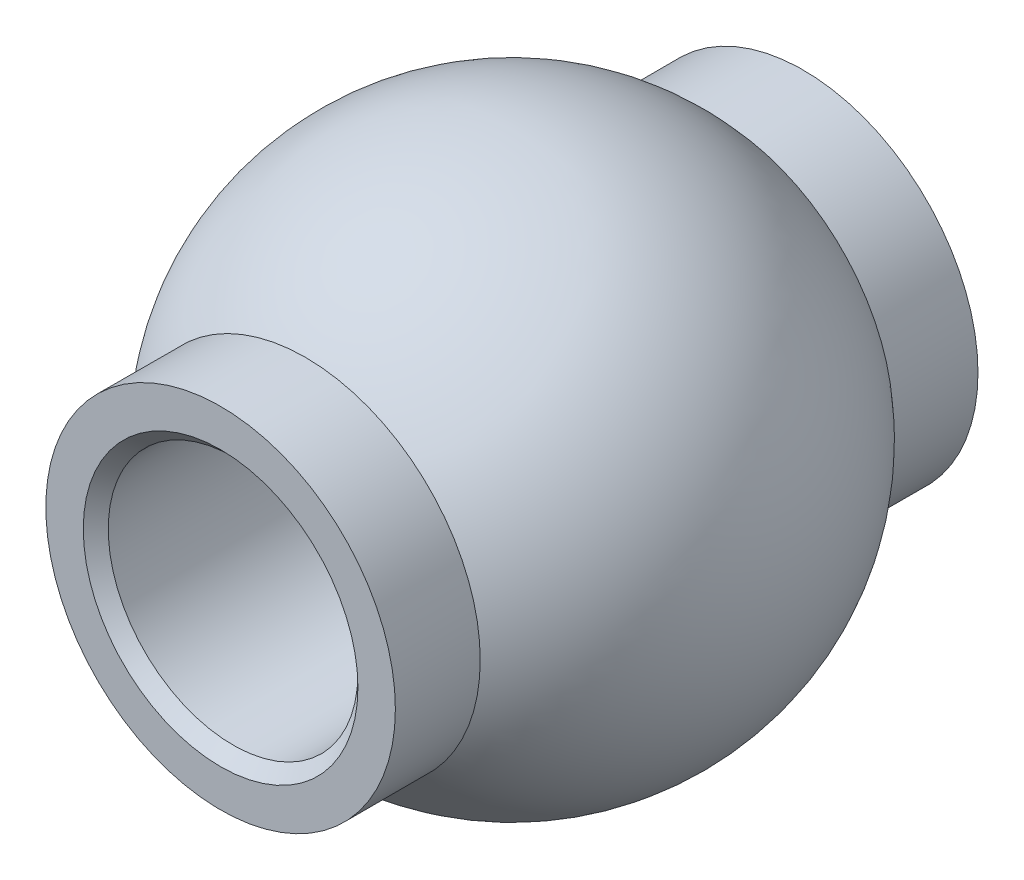
ISO-10303-21;
HEADER;
FILE_DESCRIPTION(('STEP AP214'),'2;1');
FILE_NAME('part.step','',(''),(''),'','','');
FILE_SCHEMA(('AUTOMOTIVE_DESIGN { 1 0 10303 214 1 1 1 1 }'));
ENDSEC;
DATA;
#1=APPLICATION_CONTEXT('core data for automotive mechanical design processes');
#2=APPLICATION_PROTOCOL_DEFINITION('international standard','automotive_design',2000,#1);
#3=PRODUCT_CONTEXT('',#1,'mechanical');
#4=PRODUCT('Part','Part','',(#3));
#5=PRODUCT_RELATED_PRODUCT_CATEGORY('part','',(#4));
#6=PRODUCT_DEFINITION_FORMATION('','',#4);
#7=PRODUCT_DEFINITION_CONTEXT('part definition',#1,'design');
#8=PRODUCT_DEFINITION('design','',#6,#7);
#9=PRODUCT_DEFINITION_SHAPE('','',#8);
#10=(LENGTH_UNIT() NAMED_UNIT(*) SI_UNIT(.MILLI.,.METRE.));
#11=(NAMED_UNIT(*) PLANE_ANGLE_UNIT() SI_UNIT($,.RADIAN.));
#12=(NAMED_UNIT(*) SI_UNIT($,.STERADIAN.) SOLID_ANGLE_UNIT());
#13=UNCERTAINTY_MEASURE_WITH_UNIT(LENGTH_MEASURE(1.E-05),#10,'distance_accuracy_value','');
#14=(GEOMETRIC_REPRESENTATION_CONTEXT(3) GLOBAL_UNCERTAINTY_ASSIGNED_CONTEXT((#13)) GLOBAL_UNIT_ASSIGNED_CONTEXT((#10,
#11,#12)) REPRESENTATION_CONTEXT('',''));
#15=CARTESIAN_POINT('',(0.,0.,0.));
#16=DIRECTION('',(0.,0.,1.));
#17=DIRECTION('',(1.,0.,0.));
#18=AXIS2_PLACEMENT_3D('',#15,#16,#17);
#19=CARTESIAN_POINT('',(0.,19.05,0.));
#20=DIRECTION('',(0.,-1.,0.));
#21=DIRECTION('',(-1.,0.,0.));
#22=AXIS2_PLACEMENT_3D('',#19,#20,#21);
#23=SPHERICAL_SURFACE('',#22,10.31875);
#24=CARTESIAN_POINT('',(0.,19.05,0.));
#25=DIRECTION('',(0.,0.,-1.));
#26=DIRECTION('',(-1.,0.,0.));
#27=AXIS2_PLACEMENT_3D('',#24,#25,#26);
#28=SPHERICAL_SURFACE('',#27,10.31875);
#29=CARTESIAN_POINT('',(0.,19.05,7.87534413930591));
#30=DIRECTION('',(0.,0.,-1.));
#31=DIRECTION('',(-1.,0.,0.));
#32=AXIS2_PLACEMENT_3D('',#29,#30,#31);
#33=CIRCLE('',#32,6.6675);
#34=CARTESIAN_POINT('',(-6.66750000000001,19.05,7.87534413930591));
#35=VERTEX_POINT('',#34);
#36=EDGE_CURVE('E59',#35,#35,#33,.F.);
#37=ORIENTED_EDGE('',*,*,#36,.F.);
#38=EDGE_LOOP('',(#37));
#39=FACE_BOUND('',#38,.T.);
#40=CARTESIAN_POINT('',(0.,19.05,-7.87534413930591));
#41=DIRECTION('',(0.,0.,1.));
#42=DIRECTION('',(1.,0.,0.));
#43=AXIS2_PLACEMENT_3D('',#40,#41,#42);
#44=CIRCLE('',#43,6.6675);
#45=CARTESIAN_POINT('',(6.66749999999999,19.05,-7.87534413930591));
#46=VERTEX_POINT('',#45);
#47=EDGE_CURVE('E62',#46,#46,#44,.F.);
#48=ORIENTED_EDGE('',*,*,#47,.F.);
#49=EDGE_LOOP('',(#48));
#50=FACE_BOUND('',#49,.T.);
#51=ADVANCED_FACE('F39',(#39,#50),#28,.T.);
#52=CARTESIAN_POINT('',(0.,19.05,-11.1125));
#53=DIRECTION('',(0.,0.,1.));
#54=DIRECTION('',(1.,0.,0.));
#55=AXIS2_PLACEMENT_3D('',#52,#53,#54);
#56=CYLINDRICAL_SURFACE('',#55,6.6675);
#57=ORIENTED_EDGE('',*,*,#47,.T.);
#58=EDGE_LOOP('',(#57));
#59=FACE_BOUND('',#58,.T.);
#60=CARTESIAN_POINT('',(0.,19.05,-11.1125));
#61=DIRECTION('',(0.,0.,1.));
#62=DIRECTION('',(1.,0.,0.));
#63=AXIS2_PLACEMENT_3D('',#60,#61,#62);
#64=CIRCLE('',#63,6.6675);
#65=CARTESIAN_POINT('',(6.66749999999999,19.05,-11.1125));
#66=VERTEX_POINT('',#65);
#67=EDGE_CURVE('E65',#66,#66,#64,.T.);
#68=ORIENTED_EDGE('',*,*,#67,.T.);
#69=EDGE_LOOP('',(#68));
#70=FACE_BOUND('',#69,.T.);
#71=ADVANCED_FACE('F79',(#59,#70),#56,.T.);
#72=CARTESIAN_POINT('',(0.,19.05,-11.1125));
#73=DIRECTION('',(0.,0.,1.));
#74=DIRECTION('',(1.,0.,0.));
#75=AXIS2_PLACEMENT_3D('',#72,#73,#74);
#76=PLANE('',#75);
#77=CARTESIAN_POINT('',(0.,19.05,-11.1125));
#78=DIRECTION('',(0.,0.,1.));
#79=DIRECTION('',(1.,0.,0.));
#80=AXIS2_PLACEMENT_3D('',#77,#78,#79);
#81=CIRCLE('',#80,5.23875);
#82=CARTESIAN_POINT('',(5.23874999999999,19.05,-11.1125));
#83=VERTEX_POINT('',#82);
#84=EDGE_CURVE('E54',#83,#83,#81,.T.);
#85=ORIENTED_EDGE('',*,*,#84,.T.);
#86=EDGE_LOOP('',(#85));
#87=FACE_BOUND('',#86,.T.);
#88=ORIENTED_EDGE('',*,*,#67,.F.);
#89=EDGE_LOOP('',(#88));
#90=FACE_BOUND('',#89,.T.);
#91=ADVANCED_FACE('F76',(#87,#90),#76,.F.);
#92=ORIENTED_EDGE('',*,*,#36,.T.);
#93=EDGE_LOOP('',(#92));
#94=FACE_BOUND('',#93,.T.);
#95=CARTESIAN_POINT('',(0.,19.05,11.1125));
#96=DIRECTION('',(0.,0.,1.));
#97=DIRECTION('',(1.,0.,0.));
#98=AXIS2_PLACEMENT_3D('',#95,#96,#97);
#99=CIRCLE('',#98,6.6675);
#100=CARTESIAN_POINT('',(6.66749999999999,19.05,11.1125));
#101=VERTEX_POINT('',#100);
#102=EDGE_CURVE('E68',#101,#101,#99,.T.);
#103=ORIENTED_EDGE('',*,*,#102,.F.);
#104=EDGE_LOOP('',(#103));
#105=FACE_BOUND('',#104,.T.);
#106=ADVANCED_FACE('F74',(#94,#105),#56,.T.);
#107=CARTESIAN_POINT('',(0.,19.05,11.1125));
#108=DIRECTION('',(0.,0.,1.));
#109=DIRECTION('',(1.,0.,0.));
#110=AXIS2_PLACEMENT_3D('',#107,#108,#109);
#111=PLANE('',#110);
#112=CARTESIAN_POINT('',(0.,19.05,11.1125));
#113=DIRECTION('',(0.,0.,1.));
#114=DIRECTION('',(1.,0.,0.));
#115=AXIS2_PLACEMENT_3D('',#112,#113,#114);
#116=CIRCLE('',#115,5.23875);
#117=CARTESIAN_POINT('',(5.23874999999999,19.05,11.1125));
#118=VERTEX_POINT('',#117);
#119=EDGE_CURVE('E10',#118,#118,#116,.F.);
#120=ORIENTED_EDGE('',*,*,#119,.T.);
#121=EDGE_LOOP('',(#120));
#122=FACE_BOUND('',#121,.T.);
#123=ORIENTED_EDGE('',*,*,#102,.T.);
#124=EDGE_LOOP('',(#123));
#125=FACE_BOUND('',#124,.T.);
#126=ADVANCED_FACE('F72',(#122,#125),#111,.T.);
#127=CARTESIAN_POINT('',(0.,19.05,-10.31875));
#128=DIRECTION('',(0.,0.,1.));
#129=DIRECTION('',(1.,0.,0.));
#130=AXIS2_PLACEMENT_3D('',#127,#128,#129);
#131=CYLINDRICAL_SURFACE('',#130,4.7625);
#132=CARTESIAN_POINT('',(0.,19.05,-10.63625));
#133=DIRECTION('',(0.,0.,1.));
#134=DIRECTION('',(1.,0.,0.));
#135=AXIS2_PLACEMENT_3D('',#132,#133,#134);
#136=CIRCLE('',#135,4.7625);
#137=CARTESIAN_POINT('',(4.76249999999999,19.05,-10.63625));
#138=VERTEX_POINT('',#137);
#139=EDGE_CURVE('E46',#138,#138,#136,.F.);
#140=ORIENTED_EDGE('',*,*,#139,.T.);
#141=EDGE_LOOP('',(#140));
#142=FACE_BOUND('',#141,.T.);
#143=CARTESIAN_POINT('',(0.,19.05,10.63625));
#144=DIRECTION('',(0.,0.,1.));
#145=DIRECTION('',(1.,0.,0.));
#146=AXIS2_PLACEMENT_3D('',#143,#144,#145);
#147=CIRCLE('',#146,4.7625);
#148=CARTESIAN_POINT('',(4.76249999999999,19.05,10.63625));
#149=VERTEX_POINT('',#148);
#150=EDGE_CURVE('E50',#149,#149,#147,.T.);
#151=ORIENTED_EDGE('',*,*,#150,.T.);
#152=EDGE_LOOP('',(#151));
#153=FACE_BOUND('',#152,.T.);
#154=ADVANCED_FACE('F84',(#142,#153),#131,.F.);
#155=CARTESIAN_POINT('',(0.,19.05,-11.1125));
#156=DIRECTION('',(0.,0.,-1.));
#157=DIRECTION('',(-1.,0.,0.));
#158=AXIS2_PLACEMENT_3D('',#155,#156,#157);
#159=CONICAL_SURFACE('',#158,5.23875,0.785398163397447);
#160=ORIENTED_EDGE('',*,*,#139,.F.);
#161=EDGE_LOOP('',(#160));
#162=FACE_BOUND('',#161,.T.);
#163=ORIENTED_EDGE('',*,*,#84,.F.);
#164=EDGE_LOOP('',(#163));
#165=FACE_BOUND('',#164,.T.);
#166=ADVANCED_FACE('F98',(#162,#165),#159,.F.);
#167=CARTESIAN_POINT('',(0.,19.05,10.63625));
#168=DIRECTION('',(0.,0.,1.));
#169=DIRECTION('',(1.,0.,0.));
#170=AXIS2_PLACEMENT_3D('',#167,#168,#169);
#171=CONICAL_SURFACE('',#170,4.7625,0.78539816339745);
#172=ORIENTED_EDGE('',*,*,#119,.F.);
#173=EDGE_LOOP('',(#172));
#174=FACE_BOUND('',#173,.T.);
#175=ORIENTED_EDGE('',*,*,#150,.F.);
#176=EDGE_LOOP('',(#175));
#177=FACE_BOUND('',#176,.T.);
#178=ADVANCED_FACE('F41',(#174,#177),#171,.F.);
#179=CLOSED_SHELL('',(#51,#71,#91,#106,#126,#154,#166,#178));
#180=MANIFOLD_SOLID_BREP('B2',#179);
#181=ADVANCED_BREP_SHAPE_REPRESENTATION('',(#18,#180),#14);
#182=SHAPE_DEFINITION_REPRESENTATION(#9,#181);
ENDSEC;
END-ISO-10303-21;
